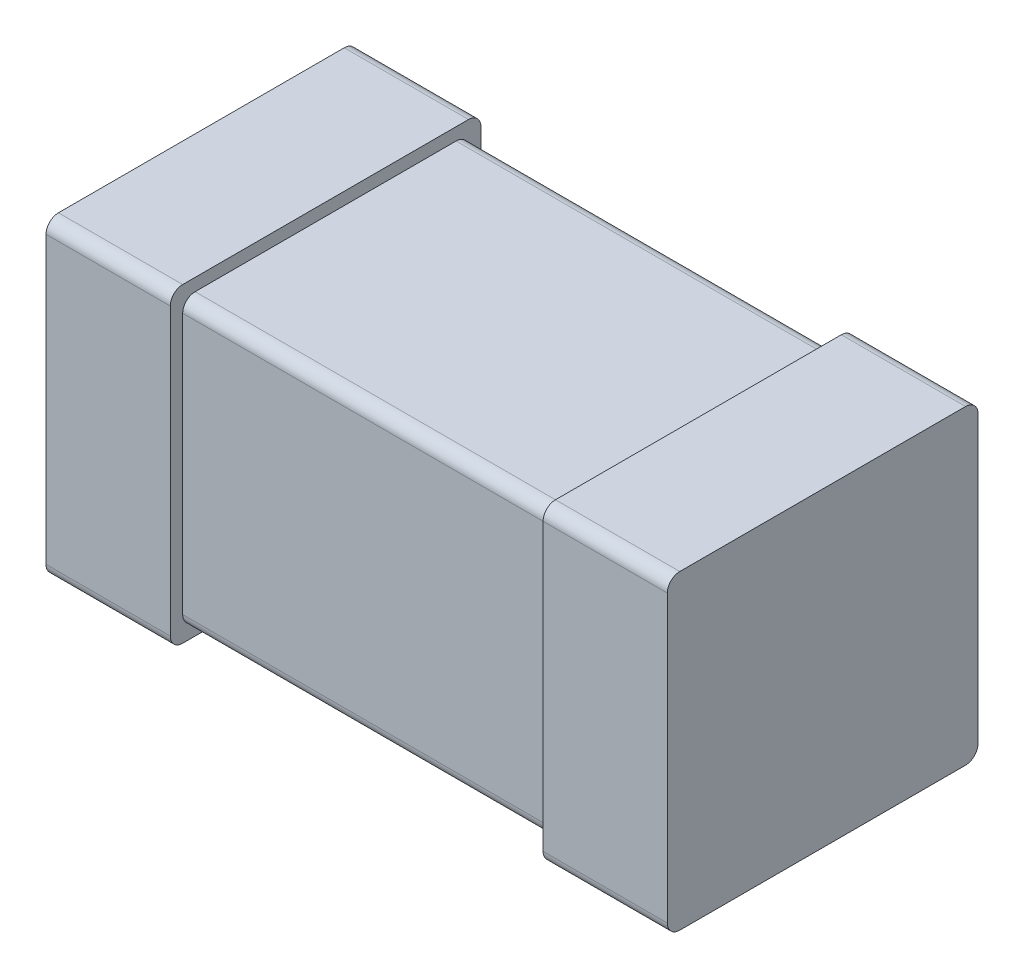
ISO-10303-21;
HEADER;
FILE_DESCRIPTION(('STEP AP214'),'2;1');
FILE_NAME('part.step','',(''),(''),'','','');
FILE_SCHEMA(('AUTOMOTIVE_DESIGN { 1 0 10303 214 1 1 1 1 }'));
ENDSEC;
DATA;
#1=APPLICATION_CONTEXT('core data for automotive mechanical design processes');
#2=APPLICATION_PROTOCOL_DEFINITION('international standard','automotive_design',2000,#1);
#3=PRODUCT_CONTEXT('',#1,'mechanical');
#4=PRODUCT('Part','Part','',(#3));
#5=PRODUCT_RELATED_PRODUCT_CATEGORY('part','',(#4));
#6=PRODUCT_DEFINITION_FORMATION('','',#4);
#7=PRODUCT_DEFINITION_CONTEXT('part definition',#1,'design');
#8=PRODUCT_DEFINITION('design','',#6,#7);
#9=PRODUCT_DEFINITION_SHAPE('','',#8);
#10=(LENGTH_UNIT() NAMED_UNIT(*) SI_UNIT(.MILLI.,.METRE.));
#11=(NAMED_UNIT(*) PLANE_ANGLE_UNIT() SI_UNIT($,.RADIAN.));
#12=(NAMED_UNIT(*) SI_UNIT($,.STERADIAN.) SOLID_ANGLE_UNIT());
#13=UNCERTAINTY_MEASURE_WITH_UNIT(LENGTH_MEASURE(1.E-05),#10,'distance_accuracy_value','');
#14=(GEOMETRIC_REPRESENTATION_CONTEXT(3) GLOBAL_UNCERTAINTY_ASSIGNED_CONTEXT((#13)) GLOBAL_UNIT_ASSIGNED_CONTEXT((#10,
#11,#12)) REPRESENTATION_CONTEXT('',''));
#15=CARTESIAN_POINT('',(0.,0.,0.));
#16=DIRECTION('',(0.,0.,1.));
#17=DIRECTION('',(1.,0.,0.));
#18=AXIS2_PLACEMENT_3D('',#15,#16,#17);
#19=CARTESIAN_POINT('',(0.5,-0.25,0.));
#20=DIRECTION('',(1.,0.,0.));
#21=DIRECTION('',(0.,1.,0.));
#22=AXIS2_PLACEMENT_3D('',#19,#20,#21);
#23=PLANE('',#22);
#24=DIRECTION('',(0.,0.,1.));
#25=VECTOR('',#24,1.);
#26=CARTESIAN_POINT('',(0.5,-0.25,0.));
#27=LINE('',#26,#25);
#28=CARTESIAN_POINT('',(0.5,-0.25,0.02));
#29=VERTEX_POINT('',#28);
#30=CARTESIAN_POINT('',(0.5,-0.25,0.48));
#31=VERTEX_POINT('',#30);
#32=EDGE_CURVE('E266',#29,#31,#27,.T.);
#33=ORIENTED_EDGE('',*,*,#32,.F.);
#34=CARTESIAN_POINT('',(0.5,-0.23,0.02));
#35=DIRECTION('',(1.,0.,0.));
#36=DIRECTION('',(0.,0.,1.));
#37=AXIS2_PLACEMENT_3D('',#34,#35,#36);
#38=CIRCLE('',#37,0.02);
#39=CARTESIAN_POINT('',(0.5,-0.23,0.));
#40=VERTEX_POINT('',#39);
#41=EDGE_CURVE('E265',#29,#40,#38,.T.);
#42=ORIENTED_EDGE('',*,*,#41,.T.);
#43=DIRECTION('',(0.,1.,0.));
#44=VECTOR('',#43,1.);
#45=CARTESIAN_POINT('',(0.5,-0.25,0.));
#46=LINE('',#45,#44);
#47=CARTESIAN_POINT('',(0.5,0.23,0.));
#48=VERTEX_POINT('',#47);
#49=EDGE_CURVE('E197',#40,#48,#46,.T.);
#50=ORIENTED_EDGE('',*,*,#49,.T.);
#51=CARTESIAN_POINT('',(0.5,0.23,0.02));
#52=DIRECTION('',(-1.,0.,0.));
#53=DIRECTION('',(0.,0.,1.));
#54=AXIS2_PLACEMENT_3D('',#51,#52,#53);
#55=CIRCLE('',#54,0.02);
#56=CARTESIAN_POINT('',(0.5,0.25,0.02));
#57=VERTEX_POINT('',#56);
#58=EDGE_CURVE('E180',#57,#48,#55,.T.);
#59=ORIENTED_EDGE('',*,*,#58,.F.);
#60=DIRECTION('',(0.,0.,1.));
#61=VECTOR('',#60,1.);
#62=CARTESIAN_POINT('',(0.5,0.25,0.));
#63=LINE('',#62,#61);
#64=CARTESIAN_POINT('',(0.5,0.25,0.48));
#65=VERTEX_POINT('',#64);
#66=EDGE_CURVE('E11',#57,#65,#63,.T.);
#67=ORIENTED_EDGE('',*,*,#66,.T.);
#68=CARTESIAN_POINT('',(0.5,0.23,0.48));
#69=DIRECTION('',(1.,0.,0.));
#70=DIRECTION('',(0.,0.,1.));
#71=AXIS2_PLACEMENT_3D('',#68,#69,#70);
#72=CIRCLE('',#71,0.02);
#73=CARTESIAN_POINT('',(0.5,0.23,0.5));
#74=VERTEX_POINT('',#73);
#75=EDGE_CURVE('E171',#65,#74,#72,.T.);
#76=ORIENTED_EDGE('',*,*,#75,.T.);
#77=DIRECTION('',(0.,1.,0.));
#78=VECTOR('',#77,1.);
#79=CARTESIAN_POINT('',(0.5,-0.25,0.5));
#80=LINE('',#79,#78);
#81=CARTESIAN_POINT('',(0.5,-0.23,0.5));
#82=VERTEX_POINT('',#81);
#83=EDGE_CURVE('E175',#82,#74,#80,.T.);
#84=ORIENTED_EDGE('',*,*,#83,.F.);
#85=CARTESIAN_POINT('',(0.5,-0.23,0.48));
#86=DIRECTION('',(-1.,0.,0.));
#87=DIRECTION('',(0.,0.,1.));
#88=AXIS2_PLACEMENT_3D('',#85,#86,#87);
#89=CIRCLE('',#88,0.02);
#90=EDGE_CURVE('E260',#31,#82,#89,.T.);
#91=ORIENTED_EDGE('',*,*,#90,.F.);
#92=EDGE_LOOP('',(#33,#42,#50,#59,#67,#76,#84,#91));
#93=FACE_BOUND('',#92,.T.);
#94=ADVANCED_FACE('F17',(#93),#23,.T.);
#95=CARTESIAN_POINT('',(0.3,0.25,0.));
#96=DIRECTION('',(0.,1.,0.));
#97=DIRECTION('',(1.,0.,0.));
#98=AXIS2_PLACEMENT_3D('',#95,#96,#97);
#99=PLANE('',#98);
#100=ORIENTED_EDGE('',*,*,#66,.F.);
#101=DIRECTION('',(1.,0.,0.));
#102=VECTOR('',#101,1.);
#103=CARTESIAN_POINT('',(0.3,0.25,0.02));
#104=LINE('',#103,#102);
#105=CARTESIAN_POINT('',(0.3,0.25,0.02));
#106=VERTEX_POINT('',#105);
#107=EDGE_CURVE('E190',#106,#57,#104,.T.);
#108=ORIENTED_EDGE('',*,*,#107,.F.);
#109=DIRECTION('',(0.,0.,1.));
#110=VECTOR('',#109,1.);
#111=CARTESIAN_POINT('',(0.3,0.25,0.));
#112=LINE('',#111,#110);
#113=CARTESIAN_POINT('',(0.3,0.25,0.48));
#114=VERTEX_POINT('',#113);
#115=EDGE_CURVE('E211',#106,#114,#112,.T.);
#116=ORIENTED_EDGE('',*,*,#115,.T.);
#117=DIRECTION('',(1.,0.,0.));
#118=VECTOR('',#117,1.);
#119=CARTESIAN_POINT('',(0.3,0.25,0.48));
#120=LINE('',#119,#118);
#121=EDGE_CURVE('E27',#114,#65,#120,.T.);
#122=ORIENTED_EDGE('',*,*,#121,.T.);
#123=EDGE_LOOP('',(#100,#108,#116,#122));
#124=FACE_BOUND('',#123,.T.);
#125=ADVANCED_FACE('F279',(#124),#99,.T.);
#126=CARTESIAN_POINT('',(0.3,0.23,0.48));
#127=DIRECTION('',(1.,0.,0.));
#128=DIRECTION('',(0.,1.,0.));
#129=AXIS2_PLACEMENT_3D('',#126,#127,#128);
#130=CYLINDRICAL_SURFACE('',#129,0.02);
#131=CARTESIAN_POINT('',(0.3,0.23,0.48));
#132=DIRECTION('',(1.,0.,0.));
#133=DIRECTION('',(0.,0.,1.));
#134=AXIS2_PLACEMENT_3D('',#131,#132,#133);
#135=CIRCLE('',#134,0.02);
#136=CARTESIAN_POINT('',(0.3,0.23,0.5));
#137=VERTEX_POINT('',#136);
#138=EDGE_CURVE('E185',#114,#137,#135,.T.);
#139=ORIENTED_EDGE('',*,*,#138,.T.);
#140=DIRECTION('',(1.,0.,0.));
#141=VECTOR('',#140,1.);
#142=CARTESIAN_POINT('',(0.3,0.23,0.5));
#143=LINE('',#142,#141);
#144=EDGE_CURVE('E183',#137,#74,#143,.T.);
#145=ORIENTED_EDGE('',*,*,#144,.T.);
#146=ORIENTED_EDGE('',*,*,#75,.F.);
#147=ORIENTED_EDGE('',*,*,#121,.F.);
#148=EDGE_LOOP('',(#139,#145,#146,#147));
#149=FACE_BOUND('',#148,.T.);
#150=ADVANCED_FACE('F19',(#149),#130,.T.);
#151=CARTESIAN_POINT('',(0.3,0.23,0.02));
#152=DIRECTION('',(1.,0.,0.));
#153=DIRECTION('',(0.,1.,0.));
#154=AXIS2_PLACEMENT_3D('',#151,#152,#153);
#155=CYLINDRICAL_SURFACE('',#154,0.02);
#156=ORIENTED_EDGE('',*,*,#107,.T.);
#157=ORIENTED_EDGE('',*,*,#58,.T.);
#158=DIRECTION('',(1.,0.,0.));
#159=VECTOR('',#158,1.);
#160=CARTESIAN_POINT('',(0.3,0.23,0.));
#161=LINE('',#160,#159);
#162=CARTESIAN_POINT('',(0.3,0.23,0.));
#163=VERTEX_POINT('',#162);
#164=EDGE_CURVE('E204',#163,#48,#161,.T.);
#165=ORIENTED_EDGE('',*,*,#164,.F.);
#166=CARTESIAN_POINT('',(0.3,0.23,0.02));
#167=DIRECTION('',(-1.,0.,0.));
#168=DIRECTION('',(0.,0.,1.));
#169=AXIS2_PLACEMENT_3D('',#166,#167,#168);
#170=CIRCLE('',#169,0.02);
#171=EDGE_CURVE('E240',#106,#163,#170,.T.);
#172=ORIENTED_EDGE('',*,*,#171,.F.);
#173=EDGE_LOOP('',(#156,#157,#165,#172));
#174=FACE_BOUND('',#173,.T.);
#175=ADVANCED_FACE('F479',(#174),#155,.T.);
#176=CARTESIAN_POINT('',(0.3,-0.25,0.5));
#177=DIRECTION('',(0.,0.,1.));
#178=DIRECTION('',(1.,0.,0.));
#179=AXIS2_PLACEMENT_3D('',#176,#177,#178);
#180=PLANE('',#179);
#181=DIRECTION('',(0.,1.,0.));
#182=VECTOR('',#181,1.);
#183=CARTESIAN_POINT('',(0.3,-0.25,0.5));
#184=LINE('',#183,#182);
#185=CARTESIAN_POINT('',(0.3,-0.23,0.5));
#186=VERTEX_POINT('',#185);
#187=EDGE_CURVE('E212',#186,#137,#184,.T.);
#188=ORIENTED_EDGE('',*,*,#187,.F.);
#189=DIRECTION('',(1.,0.,0.));
#190=VECTOR('',#189,1.);
#191=CARTESIAN_POINT('',(0.3,-0.23,0.5));
#192=LINE('',#191,#190);
#193=EDGE_CURVE('E194',#186,#82,#192,.T.);
#194=ORIENTED_EDGE('',*,*,#193,.T.);
#195=ORIENTED_EDGE('',*,*,#83,.T.);
#196=ORIENTED_EDGE('',*,*,#144,.F.);
#197=EDGE_LOOP('',(#188,#194,#195,#196));
#198=FACE_BOUND('',#197,.T.);
#199=ADVANCED_FACE('F192',(#198),#180,.T.);
#200=CARTESIAN_POINT('',(0.3,-0.25,0.));
#201=DIRECTION('',(0.,0.,1.));
#202=DIRECTION('',(1.,0.,0.));
#203=AXIS2_PLACEMENT_3D('',#200,#201,#202);
#204=PLANE('',#203);
#205=ORIENTED_EDGE('',*,*,#164,.T.);
#206=ORIENTED_EDGE('',*,*,#49,.F.);
#207=DIRECTION('',(1.,0.,0.));
#208=VECTOR('',#207,1.);
#209=CARTESIAN_POINT('',(0.3,-0.23,0.));
#210=LINE('',#209,#208);
#211=CARTESIAN_POINT('',(0.3,-0.23,0.));
#212=VERTEX_POINT('',#211);
#213=EDGE_CURVE('E261',#212,#40,#210,.T.);
#214=ORIENTED_EDGE('',*,*,#213,.F.);
#215=DIRECTION('',(0.,1.,0.));
#216=VECTOR('',#215,1.);
#217=CARTESIAN_POINT('',(0.3,-0.25,0.));
#218=LINE('',#217,#216);
#219=EDGE_CURVE('E244',#212,#163,#218,.T.);
#220=ORIENTED_EDGE('',*,*,#219,.T.);
#221=EDGE_LOOP('',(#205,#206,#214,#220));
#222=FACE_BOUND('',#221,.T.);
#223=ADVANCED_FACE('F473',(#222),#204,.F.);
#224=CARTESIAN_POINT('',(0.3,-0.23,0.48));
#225=DIRECTION('',(1.,0.,0.));
#226=DIRECTION('',(0.,-1.,0.));
#227=AXIS2_PLACEMENT_3D('',#224,#225,#226);
#228=CYLINDRICAL_SURFACE('',#227,0.02);
#229=DIRECTION('',(1.,0.,0.));
#230=VECTOR('',#229,1.);
#231=CARTESIAN_POINT('',(0.3,-0.25,0.48));
#232=LINE('',#231,#230);
#233=CARTESIAN_POINT('',(0.3,-0.25,0.48));
#234=VERTEX_POINT('',#233);
#235=EDGE_CURVE('E253',#234,#31,#232,.T.);
#236=ORIENTED_EDGE('',*,*,#235,.T.);
#237=ORIENTED_EDGE('',*,*,#90,.T.);
#238=ORIENTED_EDGE('',*,*,#193,.F.);
#239=CARTESIAN_POINT('',(0.3,-0.23,0.48));
#240=DIRECTION('',(-1.,0.,0.));
#241=DIRECTION('',(0.,0.,1.));
#242=AXIS2_PLACEMENT_3D('',#239,#240,#241);
#243=CIRCLE('',#242,0.02);
#244=EDGE_CURVE('E230',#234,#186,#243,.T.);
#245=ORIENTED_EDGE('',*,*,#244,.F.);
#246=EDGE_LOOP('',(#236,#237,#238,#245));
#247=FACE_BOUND('',#246,.T.);
#248=ADVANCED_FACE('F486',(#247),#228,.T.);
#249=CARTESIAN_POINT('',(0.3,-0.23,0.02));
#250=DIRECTION('',(1.,0.,0.));
#251=DIRECTION('',(0.,-1.,0.));
#252=AXIS2_PLACEMENT_3D('',#249,#250,#251);
#253=CYLINDRICAL_SURFACE('',#252,0.02);
#254=CARTESIAN_POINT('',(0.3,-0.23,0.02));
#255=DIRECTION('',(1.,0.,0.));
#256=DIRECTION('',(0.,0.,1.));
#257=AXIS2_PLACEMENT_3D('',#254,#255,#256);
#258=CIRCLE('',#257,0.02);
#259=CARTESIAN_POINT('',(0.3,-0.25,0.02));
#260=VERTEX_POINT('',#259);
#261=EDGE_CURVE('E245',#260,#212,#258,.T.);
#262=ORIENTED_EDGE('',*,*,#261,.T.);
#263=ORIENTED_EDGE('',*,*,#213,.T.);
#264=ORIENTED_EDGE('',*,*,#41,.F.);
#265=DIRECTION('',(1.,0.,0.));
#266=VECTOR('',#265,1.);
#267=CARTESIAN_POINT('',(0.3,-0.25,0.02));
#268=LINE('',#267,#266);
#269=EDGE_CURVE('E257',#260,#29,#268,.T.);
#270=ORIENTED_EDGE('',*,*,#269,.F.);
#271=EDGE_LOOP('',(#262,#263,#264,#270));
#272=FACE_BOUND('',#271,.T.);
#273=ADVANCED_FACE('F481',(#272),#253,.T.);
#274=CARTESIAN_POINT('',(0.3,-0.25,0.));
#275=DIRECTION('',(0.,1.,0.));
#276=DIRECTION('',(1.,0.,0.));
#277=AXIS2_PLACEMENT_3D('',#274,#275,#276);
#278=PLANE('',#277);
#279=ORIENTED_EDGE('',*,*,#235,.F.);
#280=DIRECTION('',(0.,0.,1.));
#281=VECTOR('',#280,1.);
#282=CARTESIAN_POINT('',(0.3,-0.25,0.));
#283=LINE('',#282,#281);
#284=EDGE_CURVE('E249',#260,#234,#283,.T.);
#285=ORIENTED_EDGE('',*,*,#284,.F.);
#286=ORIENTED_EDGE('',*,*,#269,.T.);
#287=ORIENTED_EDGE('',*,*,#32,.T.);
#288=EDGE_LOOP('',(#279,#285,#286,#287));
#289=FACE_BOUND('',#288,.T.);
#290=ADVANCED_FACE('F599',(#289),#278,.F.);
#291=CARTESIAN_POINT('',(0.3,-0.25,0.));
#292=DIRECTION('',(1.,0.,0.));
#293=DIRECTION('',(0.,1.,0.));
#294=AXIS2_PLACEMENT_3D('',#291,#292,#293);
#295=PLANE('',#294);
#296=DIRECTION('',(0.,1.,0.));
#297=VECTOR('',#296,1.);
#298=CARTESIAN_POINT('',(0.3,-0.23,0.02));
#299=LINE('',#298,#297);
#300=CARTESIAN_POINT('',(0.3,-0.21,0.02));
#301=VERTEX_POINT('',#300);
#302=CARTESIAN_POINT('',(0.3,0.21,0.02));
#303=VERTEX_POINT('',#302);
#304=EDGE_CURVE('E457',#301,#303,#299,.T.);
#305=ORIENTED_EDGE('',*,*,#304,.T.);
#306=CARTESIAN_POINT('',(0.3,0.21,0.04));
#307=DIRECTION('',(-1.,0.,0.));
#308=DIRECTION('',(0.,0.,1.));
#309=AXIS2_PLACEMENT_3D('',#306,#307,#308);
#310=CIRCLE('',#309,0.02);
#311=CARTESIAN_POINT('',(0.3,0.23,0.04));
#312=VERTEX_POINT('',#311);
#313=EDGE_CURVE('E465',#312,#303,#310,.T.);
#314=ORIENTED_EDGE('',*,*,#313,.F.);
#315=DIRECTION('',(0.,0.,1.));
#316=VECTOR('',#315,1.);
#317=CARTESIAN_POINT('',(0.3,0.23,0.02));
#318=LINE('',#317,#316);
#319=CARTESIAN_POINT('',(0.3,0.23,0.46));
#320=VERTEX_POINT('',#319);
#321=EDGE_CURVE('E394',#312,#320,#318,.T.);
#322=ORIENTED_EDGE('',*,*,#321,.T.);
#323=CARTESIAN_POINT('',(0.3,0.21,0.46));
#324=DIRECTION('',(1.,0.,0.));
#325=DIRECTION('',(0.,0.,1.));
#326=AXIS2_PLACEMENT_3D('',#323,#324,#325);
#327=CIRCLE('',#326,0.02);
#328=CARTESIAN_POINT('',(0.3,0.21,0.48));
#329=VERTEX_POINT('',#328);
#330=EDGE_CURVE('E208',#320,#329,#327,.T.);
#331=ORIENTED_EDGE('',*,*,#330,.T.);
#332=DIRECTION('',(0.,1.,0.));
#333=VECTOR('',#332,1.);
#334=CARTESIAN_POINT('',(0.3,-0.23,0.48));
#335=LINE('',#334,#333);
#336=CARTESIAN_POINT('',(0.3,-0.21,0.48));
#337=VERTEX_POINT('',#336);
#338=EDGE_CURVE('E217',#337,#329,#335,.T.);
#339=ORIENTED_EDGE('',*,*,#338,.F.);
#340=CARTESIAN_POINT('',(0.3,-0.21,0.46));
#341=DIRECTION('',(-1.,0.,0.));
#342=DIRECTION('',(0.,0.,1.));
#343=AXIS2_PLACEMENT_3D('',#340,#341,#342);
#344=CIRCLE('',#343,0.02);
#345=CARTESIAN_POINT('',(0.3,-0.23,0.46));
#346=VERTEX_POINT('',#345);
#347=EDGE_CURVE('E224',#346,#337,#344,.T.);
#348=ORIENTED_EDGE('',*,*,#347,.F.);
#349=DIRECTION('',(0.,0.,1.));
#350=VECTOR('',#349,1.);
#351=CARTESIAN_POINT('',(0.3,-0.23,0.02));
#352=LINE('',#351,#350);
#353=CARTESIAN_POINT('',(0.3,-0.23,0.04));
#354=VERTEX_POINT('',#353);
#355=EDGE_CURVE('E227',#354,#346,#352,.T.);
#356=ORIENTED_EDGE('',*,*,#355,.F.);
#357=CARTESIAN_POINT('',(0.3,-0.21,0.04));
#358=DIRECTION('',(1.,0.,0.));
#359=DIRECTION('',(0.,0.,1.));
#360=AXIS2_PLACEMENT_3D('',#357,#358,#359);
#361=CIRCLE('',#360,0.02);
#362=EDGE_CURVE('E448',#354,#301,#361,.T.);
#363=ORIENTED_EDGE('',*,*,#362,.T.);
#364=EDGE_LOOP('',(#305,#314,#322,#331,#339,#348,#356,#363));
#365=FACE_BOUND('',#364,.T.);
#366=ORIENTED_EDGE('',*,*,#244,.T.);
#367=ORIENTED_EDGE('',*,*,#187,.T.);
#368=ORIENTED_EDGE('',*,*,#138,.F.);
#369=ORIENTED_EDGE('',*,*,#115,.F.);
#370=ORIENTED_EDGE('',*,*,#171,.T.);
#371=ORIENTED_EDGE('',*,*,#219,.F.);
#372=ORIENTED_EDGE('',*,*,#261,.F.);
#373=ORIENTED_EDGE('',*,*,#284,.T.);
#374=EDGE_LOOP('',(#366,#367,#368,#369,#370,#371,#372,#373));
#375=FACE_BOUND('',#374,.T.);
#376=ADVANCED_FACE('F477',(#365,#375),#295,.F.);
#377=CARTESIAN_POINT('',(-0.3,-0.23,0.02));
#378=DIRECTION('',(0.,1.,0.));
#379=DIRECTION('',(1.,0.,0.));
#380=AXIS2_PLACEMENT_3D('',#377,#378,#379);
#381=PLANE('',#380);
#382=DIRECTION('',(1.,0.,0.));
#383=VECTOR('',#382,1.);
#384=CARTESIAN_POINT('',(-0.3,-0.23,0.46));
#385=LINE('',#384,#383);
#386=CARTESIAN_POINT('',(-0.3,-0.23,0.46));
#387=VERTEX_POINT('',#386);
#388=EDGE_CURVE('E220',#387,#346,#385,.T.);
#389=ORIENTED_EDGE('',*,*,#388,.F.);
#390=DIRECTION('',(0.,0.,1.));
#391=VECTOR('',#390,1.);
#392=CARTESIAN_POINT('',(-0.3,-0.23,0.02));
#393=LINE('',#392,#391);
#394=CARTESIAN_POINT('',(-0.3,-0.23,0.04));
#395=VERTEX_POINT('',#394);
#396=EDGE_CURVE('E416',#395,#387,#393,.T.);
#397=ORIENTED_EDGE('',*,*,#396,.F.);
#398=DIRECTION('',(1.,0.,0.));
#399=VECTOR('',#398,1.);
#400=CARTESIAN_POINT('',(-0.3,-0.23,0.04));
#401=LINE('',#400,#399);
#402=EDGE_CURVE('E452',#395,#354,#401,.T.);
#403=ORIENTED_EDGE('',*,*,#402,.T.);
#404=ORIENTED_EDGE('',*,*,#355,.T.);
#405=EDGE_LOOP('',(#389,#397,#403,#404));
#406=FACE_BOUND('',#405,.T.);
#407=ADVANCED_FACE('F573',(#406),#381,.F.);
#408=CARTESIAN_POINT('',(-0.3,-0.21,0.46));
#409=DIRECTION('',(1.,0.,0.));
#410=DIRECTION('',(0.,-1.,0.));
#411=AXIS2_PLACEMENT_3D('',#408,#409,#410);
#412=CYLINDRICAL_SURFACE('',#411,0.02);
#413=ORIENTED_EDGE('',*,*,#388,.T.);
#414=ORIENTED_EDGE('',*,*,#347,.T.);
#415=DIRECTION('',(1.,0.,0.));
#416=VECTOR('',#415,1.);
#417=CARTESIAN_POINT('',(-0.3,-0.21,0.48));
#418=LINE('',#417,#416);
#419=CARTESIAN_POINT('',(-0.3,-0.21,0.48));
#420=VERTEX_POINT('',#419);
#421=EDGE_CURVE('E213',#420,#337,#418,.T.);
#422=ORIENTED_EDGE('',*,*,#421,.F.);
#423=CARTESIAN_POINT('',(-0.3,-0.21,0.46));
#424=DIRECTION('',(-1.,0.,0.));
#425=DIRECTION('',(0.,0.,1.));
#426=AXIS2_PLACEMENT_3D('',#423,#424,#425);
#427=CIRCLE('',#426,0.02);
#428=EDGE_CURVE('E420',#387,#420,#427,.T.);
#429=ORIENTED_EDGE('',*,*,#428,.F.);
#430=EDGE_LOOP('',(#413,#414,#422,#429));
#431=FACE_BOUND('',#430,.T.);
#432=ADVANCED_FACE('F570',(#431),#412,.T.);
#433=CARTESIAN_POINT('',(-0.3,-0.23,0.48));
#434=DIRECTION('',(0.,0.,1.));
#435=DIRECTION('',(1.,0.,0.));
#436=AXIS2_PLACEMENT_3D('',#433,#434,#435);
#437=PLANE('',#436);
#438=DIRECTION('',(0.,1.,0.));
#439=VECTOR('',#438,1.);
#440=CARTESIAN_POINT('',(-0.3,-0.23,0.48));
#441=LINE('',#440,#439);
#442=CARTESIAN_POINT('',(-0.3,0.21,0.48));
#443=VERTEX_POINT('',#442);
#444=EDGE_CURVE('E430',#420,#443,#441,.T.);
#445=ORIENTED_EDGE('',*,*,#444,.F.);
#446=ORIENTED_EDGE('',*,*,#421,.T.);
#447=ORIENTED_EDGE('',*,*,#338,.T.);
#448=DIRECTION('',(1.,0.,0.));
#449=VECTOR('',#448,1.);
#450=CARTESIAN_POINT('',(-0.3,0.21,0.48));
#451=LINE('',#450,#449);
#452=EDGE_CURVE('E366',#443,#329,#451,.T.);
#453=ORIENTED_EDGE('',*,*,#452,.F.);
#454=EDGE_LOOP('',(#445,#446,#447,#453));
#455=FACE_BOUND('',#454,.T.);
#456=ADVANCED_FACE('F567',(#455),#437,.T.);
#457=CARTESIAN_POINT('',(-0.3,0.21,0.46));
#458=DIRECTION('',(1.,0.,0.));
#459=DIRECTION('',(0.,1.,0.));
#460=AXIS2_PLACEMENT_3D('',#457,#458,#459);
#461=CYLINDRICAL_SURFACE('',#460,0.02);
#462=CARTESIAN_POINT('',(-0.3,0.21,0.46));
#463=DIRECTION('',(1.,0.,0.));
#464=DIRECTION('',(0.,0.,1.));
#465=AXIS2_PLACEMENT_3D('',#462,#463,#464);
#466=CIRCLE('',#465,0.02);
#467=CARTESIAN_POINT('',(-0.3,0.23,0.46));
#468=VERTEX_POINT('',#467);
#469=EDGE_CURVE('E437',#468,#443,#466,.T.);
#470=ORIENTED_EDGE('',*,*,#469,.T.);
#471=ORIENTED_EDGE('',*,*,#452,.T.);
#472=ORIENTED_EDGE('',*,*,#330,.F.);
#473=DIRECTION('',(1.,0.,0.));
#474=VECTOR('',#473,1.);
#475=CARTESIAN_POINT('',(-0.3,0.23,0.46));
#476=LINE('',#475,#474);
#477=EDGE_CURVE('E370',#468,#320,#476,.T.);
#478=ORIENTED_EDGE('',*,*,#477,.F.);
#479=EDGE_LOOP('',(#470,#471,#472,#478));
#480=FACE_BOUND('',#479,.T.);
#481=ADVANCED_FACE('F564',(#480),#461,.T.);
#482=CARTESIAN_POINT('',(-0.3,0.23,0.02));
#483=DIRECTION('',(0.,1.,0.));
#484=DIRECTION('',(1.,0.,0.));
#485=AXIS2_PLACEMENT_3D('',#482,#483,#484);
#486=PLANE('',#485);
#487=ORIENTED_EDGE('',*,*,#321,.F.);
#488=DIRECTION('',(1.,0.,0.));
#489=VECTOR('',#488,1.);
#490=CARTESIAN_POINT('',(-0.3,0.23,0.04));
#491=LINE('',#490,#489);
#492=CARTESIAN_POINT('',(-0.3,0.23,0.04));
#493=VERTEX_POINT('',#492);
#494=EDGE_CURVE('E461',#493,#312,#491,.T.);
#495=ORIENTED_EDGE('',*,*,#494,.F.);
#496=DIRECTION('',(0.,0.,1.));
#497=VECTOR('',#496,1.);
#498=CARTESIAN_POINT('',(-0.3,0.23,0.02));
#499=LINE('',#498,#497);
#500=EDGE_CURVE('E441',#493,#468,#499,.T.);
#501=ORIENTED_EDGE('',*,*,#500,.T.);
#502=ORIENTED_EDGE('',*,*,#477,.T.);
#503=EDGE_LOOP('',(#487,#495,#501,#502));
#504=FACE_BOUND('',#503,.T.);
#505=ADVANCED_FACE('F559',(#504),#486,.T.);
#506=CARTESIAN_POINT('',(-0.3,0.21,0.04));
#507=DIRECTION('',(1.,0.,0.));
#508=DIRECTION('',(0.,1.,0.));
#509=AXIS2_PLACEMENT_3D('',#506,#507,#508);
#510=CYLINDRICAL_SURFACE('',#509,0.02);
#511=ORIENTED_EDGE('',*,*,#494,.T.);
#512=ORIENTED_EDGE('',*,*,#313,.T.);
#513=DIRECTION('',(1.,0.,0.));
#514=VECTOR('',#513,1.);
#515=CARTESIAN_POINT('',(-0.3,0.21,0.02));
#516=LINE('',#515,#514);
#517=CARTESIAN_POINT('',(-0.3,0.21,0.02));
#518=VERTEX_POINT('',#517);
#519=EDGE_CURVE('E453',#518,#303,#516,.T.);
#520=ORIENTED_EDGE('',*,*,#519,.F.);
#521=CARTESIAN_POINT('',(-0.3,0.21,0.04));
#522=DIRECTION('',(-1.,0.,0.));
#523=DIRECTION('',(0.,0.,1.));
#524=AXIS2_PLACEMENT_3D('',#521,#522,#523);
#525=CIRCLE('',#524,0.02);
#526=EDGE_CURVE('E386',#493,#518,#525,.T.);
#527=ORIENTED_EDGE('',*,*,#526,.F.);
#528=EDGE_LOOP('',(#511,#512,#520,#527));
#529=FACE_BOUND('',#528,.T.);
#530=ADVANCED_FACE('F547',(#529),#510,.T.);
#531=CARTESIAN_POINT('',(-0.3,-0.23,0.02));
#532=DIRECTION('',(0.,0.,1.));
#533=DIRECTION('',(1.,0.,0.));
#534=AXIS2_PLACEMENT_3D('',#531,#532,#533);
#535=PLANE('',#534);
#536=ORIENTED_EDGE('',*,*,#519,.T.);
#537=ORIENTED_EDGE('',*,*,#304,.F.);
#538=DIRECTION('',(1.,0.,0.));
#539=VECTOR('',#538,1.);
#540=CARTESIAN_POINT('',(-0.3,-0.21,0.02));
#541=LINE('',#540,#539);
#542=CARTESIAN_POINT('',(-0.3,-0.21,0.02));
#543=VERTEX_POINT('',#542);
#544=EDGE_CURVE('E385',#543,#301,#541,.T.);
#545=ORIENTED_EDGE('',*,*,#544,.F.);
#546=DIRECTION('',(0.,1.,0.));
#547=VECTOR('',#546,1.);
#548=CARTESIAN_POINT('',(-0.3,-0.23,0.02));
#549=LINE('',#548,#547);
#550=EDGE_CURVE('E381',#543,#518,#549,.T.);
#551=ORIENTED_EDGE('',*,*,#550,.T.);
#552=EDGE_LOOP('',(#536,#537,#545,#551));
#553=FACE_BOUND('',#552,.T.);
#554=ADVANCED_FACE('F552',(#553),#535,.F.);
#555=CARTESIAN_POINT('',(-0.3,-0.21,0.04));
#556=DIRECTION('',(1.,0.,0.));
#557=DIRECTION('',(0.,-1.,0.));
#558=AXIS2_PLACEMENT_3D('',#555,#556,#557);
#559=CYLINDRICAL_SURFACE('',#558,0.02);
#560=CARTESIAN_POINT('',(-0.3,-0.21,0.04));
#561=DIRECTION('',(1.,0.,0.));
#562=DIRECTION('',(0.,0.,1.));
#563=AXIS2_PLACEMENT_3D('',#560,#561,#562);
#564=CIRCLE('',#563,0.02);
#565=EDGE_CURVE('E421',#395,#543,#564,.T.);
#566=ORIENTED_EDGE('',*,*,#565,.T.);
#567=ORIENTED_EDGE('',*,*,#544,.T.);
#568=ORIENTED_EDGE('',*,*,#362,.F.);
#569=ORIENTED_EDGE('',*,*,#402,.F.);
#570=EDGE_LOOP('',(#566,#567,#568,#569));
#571=FACE_BOUND('',#570,.T.);
#572=ADVANCED_FACE('F575',(#571),#559,.T.);
#573=CARTESIAN_POINT('',(-0.3,-0.25,0.));
#574=DIRECTION('',(1.,0.,0.));
#575=DIRECTION('',(0.,1.,0.));
#576=AXIS2_PLACEMENT_3D('',#573,#574,#575);
#577=PLANE('',#576);
#578=ORIENTED_EDGE('',*,*,#565,.F.);
#579=ORIENTED_EDGE('',*,*,#396,.T.);
#580=ORIENTED_EDGE('',*,*,#428,.T.);
#581=ORIENTED_EDGE('',*,*,#444,.T.);
#582=ORIENTED_EDGE('',*,*,#469,.F.);
#583=ORIENTED_EDGE('',*,*,#500,.F.);
#584=ORIENTED_EDGE('',*,*,#526,.T.);
#585=ORIENTED_EDGE('',*,*,#550,.F.);
#586=EDGE_LOOP('',(#578,#579,#580,#581,#582,#583,#584,#585));
#587=FACE_BOUND('',#586,.T.);
#588=DIRECTION('',(0.,0.,1.));
#589=VECTOR('',#588,1.);
#590=CARTESIAN_POINT('',(-0.3,-0.25,0.));
#591=LINE('',#590,#589);
#592=CARTESIAN_POINT('',(-0.3,-0.25,0.02));
#593=VERTEX_POINT('',#592);
#594=CARTESIAN_POINT('',(-0.3,-0.25,0.48));
#595=VERTEX_POINT('',#594);
#596=EDGE_CURVE('E341',#593,#595,#591,.T.);
#597=ORIENTED_EDGE('',*,*,#596,.F.);
#598=CARTESIAN_POINT('',(-0.3,-0.23,0.02));
#599=DIRECTION('',(1.,0.,0.));
#600=DIRECTION('',(0.,0.,1.));
#601=AXIS2_PLACEMENT_3D('',#598,#599,#600);
#602=CIRCLE('',#601,0.02);
#603=CARTESIAN_POINT('',(-0.3,-0.23,0.));
#604=VERTEX_POINT('',#603);
#605=EDGE_CURVE('E331',#593,#604,#602,.T.);
#606=ORIENTED_EDGE('',*,*,#605,.T.);
#607=DIRECTION('',(0.,1.,0.));
#608=VECTOR('',#607,1.);
#609=CARTESIAN_POINT('',(-0.3,-0.25,0.));
#610=LINE('',#609,#608);
#611=CARTESIAN_POINT('',(-0.3,0.23,0.));
#612=VERTEX_POINT('',#611);
#613=EDGE_CURVE('E364',#604,#612,#610,.T.);
#614=ORIENTED_EDGE('',*,*,#613,.T.);
#615=CARTESIAN_POINT('',(-0.3,0.23,0.02));
#616=DIRECTION('',(-1.,0.,0.));
#617=DIRECTION('',(0.,0.,1.));
#618=AXIS2_PLACEMENT_3D('',#615,#616,#617);
#619=CIRCLE('',#618,0.02);
#620=CARTESIAN_POINT('',(-0.3,0.25,0.02));
#621=VERTEX_POINT('',#620);
#622=EDGE_CURVE('E402',#621,#612,#619,.T.);
#623=ORIENTED_EDGE('',*,*,#622,.F.);
#624=DIRECTION('',(0.,0.,1.));
#625=VECTOR('',#624,1.);
#626=CARTESIAN_POINT('',(-0.3,0.25,0.));
#627=LINE('',#626,#625);
#628=CARTESIAN_POINT('',(-0.3,0.25,0.48));
#629=VERTEX_POINT('',#628);
#630=EDGE_CURVE('E414',#621,#629,#627,.T.);
#631=ORIENTED_EDGE('',*,*,#630,.T.);
#632=CARTESIAN_POINT('',(-0.3,0.23,0.48));
#633=DIRECTION('',(1.,0.,0.));
#634=DIRECTION('',(0.,0.,1.));
#635=AXIS2_PLACEMENT_3D('',#632,#633,#634);
#636=CIRCLE('',#635,0.02);
#637=CARTESIAN_POINT('',(-0.3,0.23,0.5));
#638=VERTEX_POINT('',#637);
#639=EDGE_CURVE('E408',#629,#638,#636,.T.);
#640=ORIENTED_EDGE('',*,*,#639,.T.);
#641=DIRECTION('',(0.,1.,0.));
#642=VECTOR('',#641,1.);
#643=CARTESIAN_POINT('',(-0.3,-0.25,0.5));
#644=LINE('',#643,#642);
#645=CARTESIAN_POINT('',(-0.3,-0.23,0.5));
#646=VERTEX_POINT('',#645);
#647=EDGE_CURVE('E380',#646,#638,#644,.T.);
#648=ORIENTED_EDGE('',*,*,#647,.F.);
#649=CARTESIAN_POINT('',(-0.3,-0.23,0.48));
#650=DIRECTION('',(-1.,0.,0.));
#651=DIRECTION('',(0.,0.,1.));
#652=AXIS2_PLACEMENT_3D('',#649,#650,#651);
#653=CIRCLE('',#652,0.02);
#654=EDGE_CURVE('E324',#595,#646,#653,.T.);
#655=ORIENTED_EDGE('',*,*,#654,.F.);
#656=EDGE_LOOP('',(#597,#606,#614,#623,#631,#640,#648,#655));
#657=FACE_BOUND('',#656,.T.);
#658=ADVANCED_FACE('F342',(#587,#657),#577,.T.);
#659=CARTESIAN_POINT('',(-0.5,0.25,0.));
#660=DIRECTION('',(0.,1.,0.));
#661=DIRECTION('',(1.,0.,0.));
#662=AXIS2_PLACEMENT_3D('',#659,#660,#661);
#663=PLANE('',#662);
#664=ORIENTED_EDGE('',*,*,#630,.F.);
#665=DIRECTION('',(1.,0.,0.));
#666=VECTOR('',#665,1.);
#667=CARTESIAN_POINT('',(-0.5,0.25,0.02));
#668=LINE('',#667,#666);
#669=CARTESIAN_POINT('',(-0.5,0.25,0.02));
#670=VERTEX_POINT('',#669);
#671=EDGE_CURVE('E398',#670,#621,#668,.T.);
#672=ORIENTED_EDGE('',*,*,#671,.F.);
#673=DIRECTION('',(0.,0.,1.));
#674=VECTOR('',#673,1.);
#675=CARTESIAN_POINT('',(-0.5,0.25,0.));
#676=LINE('',#675,#674);
#677=CARTESIAN_POINT('',(-0.5,0.25,0.48));
#678=VERTEX_POINT('',#677);
#679=EDGE_CURVE('E532',#670,#678,#676,.T.);
#680=ORIENTED_EDGE('',*,*,#679,.T.);
#681=DIRECTION('',(1.,0.,0.));
#682=VECTOR('',#681,1.);
#683=CARTESIAN_POINT('',(-0.5,0.25,0.48));
#684=LINE('',#683,#682);
#685=EDGE_CURVE('E411',#678,#629,#684,.T.);
#686=ORIENTED_EDGE('',*,*,#685,.T.);
#687=EDGE_LOOP('',(#664,#672,#680,#686));
#688=FACE_BOUND('',#687,.T.);
#689=ADVANCED_FACE('F584',(#688),#663,.T.);
#690=CARTESIAN_POINT('',(-0.5,0.23,0.48));
#691=DIRECTION('',(1.,0.,0.));
#692=DIRECTION('',(0.,1.,0.));
#693=AXIS2_PLACEMENT_3D('',#690,#691,#692);
#694=CYLINDRICAL_SURFACE('',#693,0.02);
#695=CARTESIAN_POINT('',(-0.5,0.23,0.48));
#696=DIRECTION('',(1.,0.,0.));
#697=DIRECTION('',(0.,0.,1.));
#698=AXIS2_PLACEMENT_3D('',#695,#696,#697);
#699=CIRCLE('',#698,0.02);
#700=CARTESIAN_POINT('',(-0.5,0.23,0.5));
#701=VERTEX_POINT('',#700);
#702=EDGE_CURVE('E516',#678,#701,#699,.T.);
#703=ORIENTED_EDGE('',*,*,#702,.T.);
#704=DIRECTION('',(1.,0.,0.));
#705=VECTOR('',#704,1.);
#706=CARTESIAN_POINT('',(-0.5,0.23,0.5));
#707=LINE('',#706,#705);
#708=EDGE_CURVE('E390',#701,#638,#707,.T.);
#709=ORIENTED_EDGE('',*,*,#708,.T.);
#710=ORIENTED_EDGE('',*,*,#639,.F.);
#711=ORIENTED_EDGE('',*,*,#685,.F.);
#712=EDGE_LOOP('',(#703,#709,#710,#711));
#713=FACE_BOUND('',#712,.T.);
#714=ADVANCED_FACE('F729',(#713),#694,.T.);
#715=CARTESIAN_POINT('',(-0.5,0.23,0.02));
#716=DIRECTION('',(1.,0.,0.));
#717=DIRECTION('',(0.,1.,0.));
#718=AXIS2_PLACEMENT_3D('',#715,#716,#717);
#719=CYLINDRICAL_SURFACE('',#718,0.02);
#720=ORIENTED_EDGE('',*,*,#671,.T.);
#721=ORIENTED_EDGE('',*,*,#622,.T.);
#722=DIRECTION('',(1.,0.,0.));
#723=VECTOR('',#722,1.);
#724=CARTESIAN_POINT('',(-0.5,0.23,0.));
#725=LINE('',#724,#723);
#726=CARTESIAN_POINT('',(-0.5,0.23,0.));
#727=VERTEX_POINT('',#726);
#728=EDGE_CURVE('E360',#727,#612,#725,.T.);
#729=ORIENTED_EDGE('',*,*,#728,.F.);
#730=CARTESIAN_POINT('',(-0.5,0.23,0.02));
#731=DIRECTION('',(-1.,0.,0.));
#732=DIRECTION('',(0.,0.,1.));
#733=AXIS2_PLACEMENT_3D('',#730,#731,#732);
#734=CIRCLE('',#733,0.02);
#735=EDGE_CURVE('E536',#670,#727,#734,.T.);
#736=ORIENTED_EDGE('',*,*,#735,.F.);
#737=EDGE_LOOP('',(#720,#721,#729,#736));
#738=FACE_BOUND('',#737,.T.);
#739=ADVANCED_FACE('F740',(#738),#719,.T.);
#740=CARTESIAN_POINT('',(-0.5,-0.25,0.5));
#741=DIRECTION('',(0.,0.,1.));
#742=DIRECTION('',(1.,0.,0.));
#743=AXIS2_PLACEMENT_3D('',#740,#741,#742);
#744=PLANE('',#743);
#745=DIRECTION('',(0.,1.,0.));
#746=VECTOR('',#745,1.);
#747=CARTESIAN_POINT('',(-0.5,-0.25,0.5));
#748=LINE('',#747,#746);
#749=CARTESIAN_POINT('',(-0.5,-0.23,0.5));
#750=VERTEX_POINT('',#749);
#751=EDGE_CURVE('E511',#750,#701,#748,.T.);
#752=ORIENTED_EDGE('',*,*,#751,.F.);
#753=DIRECTION('',(1.,0.,0.));
#754=VECTOR('',#753,1.);
#755=CARTESIAN_POINT('',(-0.5,-0.23,0.5));
#756=LINE('',#755,#754);
#757=EDGE_CURVE('E365',#750,#646,#756,.T.);
#758=ORIENTED_EDGE('',*,*,#757,.T.);
#759=ORIENTED_EDGE('',*,*,#647,.T.);
#760=ORIENTED_EDGE('',*,*,#708,.F.);
#761=EDGE_LOOP('',(#752,#758,#759,#760));
#762=FACE_BOUND('',#761,.T.);
#763=ADVANCED_FACE('F735',(#762),#744,.T.);
#764=CARTESIAN_POINT('',(-0.5,-0.25,0.));
#765=DIRECTION('',(0.,0.,1.));
#766=DIRECTION('',(1.,0.,0.));
#767=AXIS2_PLACEMENT_3D('',#764,#765,#766);
#768=PLANE('',#767);
#769=ORIENTED_EDGE('',*,*,#728,.T.);
#770=ORIENTED_EDGE('',*,*,#613,.F.);
#771=DIRECTION('',(1.,0.,0.));
#772=VECTOR('',#771,1.);
#773=CARTESIAN_POINT('',(-0.5,-0.23,0.));
#774=LINE('',#773,#772);
#775=CARTESIAN_POINT('',(-0.5,-0.23,0.));
#776=VERTEX_POINT('',#775);
#777=EDGE_CURVE('E337',#776,#604,#774,.T.);
#778=ORIENTED_EDGE('',*,*,#777,.F.);
#779=DIRECTION('',(0.,1.,0.));
#780=VECTOR('',#779,1.);
#781=CARTESIAN_POINT('',(-0.5,-0.25,0.));
#782=LINE('',#781,#780);
#783=EDGE_CURVE('E528',#776,#727,#782,.T.);
#784=ORIENTED_EDGE('',*,*,#783,.T.);
#785=EDGE_LOOP('',(#769,#770,#778,#784));
#786=FACE_BOUND('',#785,.T.);
#787=ADVANCED_FACE('F739',(#786),#768,.F.);
#788=CARTESIAN_POINT('',(-0.5,-0.23,0.48));
#789=DIRECTION('',(1.,0.,0.));
#790=DIRECTION('',(0.,-1.,0.));
#791=AXIS2_PLACEMENT_3D('',#788,#789,#790);
#792=CYLINDRICAL_SURFACE('',#791,0.02);
#793=DIRECTION('',(1.,0.,0.));
#794=VECTOR('',#793,1.);
#795=CARTESIAN_POINT('',(-0.5,-0.25,0.48));
#796=LINE('',#795,#794);
#797=CARTESIAN_POINT('',(-0.5,-0.25,0.48));
#798=VERTEX_POINT('',#797);
#799=EDGE_CURVE('E353',#798,#595,#796,.T.);
#800=ORIENTED_EDGE('',*,*,#799,.T.);
#801=ORIENTED_EDGE('',*,*,#654,.T.);
#802=ORIENTED_EDGE('',*,*,#757,.F.);
#803=CARTESIAN_POINT('',(-0.5,-0.23,0.48));
#804=DIRECTION('',(-1.,0.,0.));
#805=DIRECTION('',(0.,0.,1.));
#806=AXIS2_PLACEMENT_3D('',#803,#804,#805);
#807=CIRCLE('',#806,0.02);
#808=EDGE_CURVE('E504',#798,#750,#807,.T.);
#809=ORIENTED_EDGE('',*,*,#808,.F.);
#810=EDGE_LOOP('',(#800,#801,#802,#809));
#811=FACE_BOUND('',#810,.T.);
#812=ADVANCED_FACE('F508',(#811),#792,.T.);
#813=CARTESIAN_POINT('',(-0.5,-0.23,0.02));
#814=DIRECTION('',(1.,0.,0.));
#815=DIRECTION('',(0.,-1.,0.));
#816=AXIS2_PLACEMENT_3D('',#813,#814,#815);
#817=CYLINDRICAL_SURFACE('',#816,0.02);
#818=CARTESIAN_POINT('',(-0.5,-0.23,0.02));
#819=DIRECTION('',(1.,0.,0.));
#820=DIRECTION('',(0.,0.,1.));
#821=AXIS2_PLACEMENT_3D('',#818,#819,#820);
#822=CIRCLE('',#821,0.02);
#823=CARTESIAN_POINT('',(-0.5,-0.25,0.02));
#824=VERTEX_POINT('',#823);
#825=EDGE_CURVE('E506',#824,#776,#822,.T.);
#826=ORIENTED_EDGE('',*,*,#825,.T.);
#827=ORIENTED_EDGE('',*,*,#777,.T.);
#828=ORIENTED_EDGE('',*,*,#605,.F.);
#829=DIRECTION('',(1.,0.,0.));
#830=VECTOR('',#829,1.);
#831=CARTESIAN_POINT('',(-0.5,-0.25,0.02));
#832=LINE('',#831,#830);
#833=EDGE_CURVE('E335',#824,#593,#832,.T.);
#834=ORIENTED_EDGE('',*,*,#833,.F.);
#835=EDGE_LOOP('',(#826,#827,#828,#834));
#836=FACE_BOUND('',#835,.T.);
#837=ADVANCED_FACE('F333',(#836),#817,.T.);
#838=CARTESIAN_POINT('',(-0.5,-0.25,0.));
#839=DIRECTION('',(0.,1.,0.));
#840=DIRECTION('',(1.,0.,0.));
#841=AXIS2_PLACEMENT_3D('',#838,#839,#840);
#842=PLANE('',#841);
#843=ORIENTED_EDGE('',*,*,#799,.F.);
#844=DIRECTION('',(0.,0.,1.));
#845=VECTOR('',#844,1.);
#846=CARTESIAN_POINT('',(-0.5,-0.25,0.));
#847=LINE('',#846,#845);
#848=EDGE_CURVE('E350',#824,#798,#847,.T.);
#849=ORIENTED_EDGE('',*,*,#848,.F.);
#850=ORIENTED_EDGE('',*,*,#833,.T.);
#851=ORIENTED_EDGE('',*,*,#596,.T.);
#852=EDGE_LOOP('',(#843,#849,#850,#851));
#853=FACE_BOUND('',#852,.T.);
#854=ADVANCED_FACE('F348',(#853),#842,.F.);
#855=CARTESIAN_POINT('',(-0.5,-0.25,0.));
#856=DIRECTION('',(1.,0.,0.));
#857=DIRECTION('',(0.,1.,0.));
#858=AXIS2_PLACEMENT_3D('',#855,#856,#857);
#859=PLANE('',#858);
#860=ORIENTED_EDGE('',*,*,#808,.T.);
#861=ORIENTED_EDGE('',*,*,#751,.T.);
#862=ORIENTED_EDGE('',*,*,#702,.F.);
#863=ORIENTED_EDGE('',*,*,#679,.F.);
#864=ORIENTED_EDGE('',*,*,#735,.T.);
#865=ORIENTED_EDGE('',*,*,#783,.F.);
#866=ORIENTED_EDGE('',*,*,#825,.F.);
#867=ORIENTED_EDGE('',*,*,#848,.T.);
#868=EDGE_LOOP('',(#860,#861,#862,#863,#864,#865,#866,#867));
#869=FACE_BOUND('',#868,.T.);
#870=ADVANCED_FACE('F502',(#869),#859,.F.);
#871=CLOSED_SHELL('',(#94,#125,#150,#175,#199,#223,#248,#273,#290,#376,#407,#432,#456,#481,#505,
#530,#554,#572,#658,#689,#714,#739,#763,#787,#812,#837,#854,#870));
#872=MANIFOLD_SOLID_BREP('B1',#871);
#873=ADVANCED_BREP_SHAPE_REPRESENTATION('',(#18,#872),#14);
#874=SHAPE_DEFINITION_REPRESENTATION(#9,#873);
ENDSEC;
END-ISO-10303-21;
